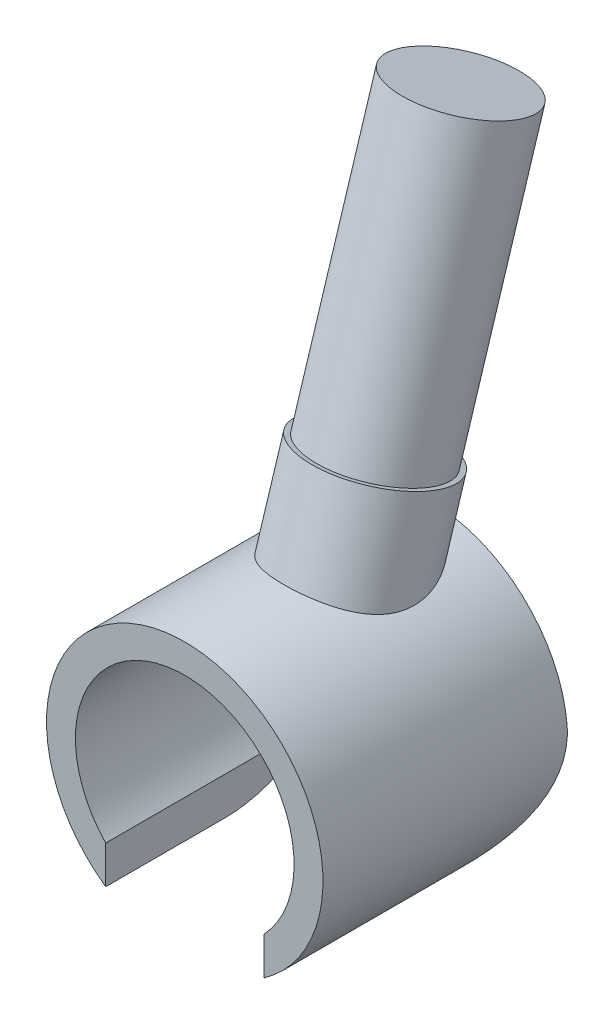
ISO-10303-21;
HEADER;
FILE_DESCRIPTION(('STEP AP214'),'2;1');
FILE_NAME('part.step','',(''),(''),'','','');
FILE_SCHEMA(('AUTOMOTIVE_DESIGN { 1 0 10303 214 1 1 1 1 }'));
ENDSEC;
DATA;
#1=APPLICATION_CONTEXT('core data for automotive mechanical design processes');
#2=APPLICATION_PROTOCOL_DEFINITION('international standard','automotive_design',2000,#1);
#3=PRODUCT_CONTEXT('',#1,'mechanical');
#4=PRODUCT('Part','Part','',(#3));
#5=PRODUCT_RELATED_PRODUCT_CATEGORY('part','',(#4));
#6=PRODUCT_DEFINITION_FORMATION('','',#4);
#7=PRODUCT_DEFINITION_CONTEXT('part definition',#1,'design');
#8=PRODUCT_DEFINITION('design','',#6,#7);
#9=PRODUCT_DEFINITION_SHAPE('','',#8);
#10=(LENGTH_UNIT() NAMED_UNIT(*) SI_UNIT(.MILLI.,.METRE.));
#11=(NAMED_UNIT(*) PLANE_ANGLE_UNIT() SI_UNIT($,.RADIAN.));
#12=(NAMED_UNIT(*) SI_UNIT($,.STERADIAN.) SOLID_ANGLE_UNIT());
#13=UNCERTAINTY_MEASURE_WITH_UNIT(LENGTH_MEASURE(1.E-05),#10,'distance_accuracy_value','');
#14=(GEOMETRIC_REPRESENTATION_CONTEXT(3) GLOBAL_UNCERTAINTY_ASSIGNED_CONTEXT((#13)) GLOBAL_UNIT_ASSIGNED_CONTEXT((#10,
#11,#12)) REPRESENTATION_CONTEXT('',''));
#15=CARTESIAN_POINT('',(0.,0.,0.));
#16=DIRECTION('',(0.,0.,1.));
#17=DIRECTION('',(1.,0.,0.));
#18=AXIS2_PLACEMENT_3D('',#15,#16,#17);
#19=CARTESIAN_POINT('',(1.395,-1.33374472819952,4.32));
#20=DIRECTION('',(1.,0.,0.));
#21=DIRECTION('',(0.,0.,-1.));
#22=AXIS2_PLACEMENT_3D('',#19,#20,#21);
#23=PLANE('',#22);
#24=DIRECTION('',(0.,0.,-1.));
#25=VECTOR('',#24,1.);
#26=CARTESIAN_POINT('',(1.395,-1.33374472819952,4.32));
#27=LINE('',#26,#25);
#28=CARTESIAN_POINT('',(1.395,-1.33374472819952,4.32));
#29=VERTEX_POINT('',#28);
#30=CARTESIAN_POINT('',(1.395,-1.33374472819952,0.632500153890069));
#31=VERTEX_POINT('',#30);
#32=EDGE_CURVE('E128',#29,#31,#27,.T.);
#33=ORIENTED_EDGE('',*,*,#32,.T.);
#34=CARTESIAN_POINT('',(1.395,0.218107145724328,2.22));
#35=DIRECTION('',(1.,0.,0.));
#36=DIRECTION('',(0.,0.,-1.));
#37=AXIS2_PLACEMENT_3D('',#34,#35,#36);
#38=CIRCLE('',#37,2.22);
#39=CARTESIAN_POINT('',(1.395,-2.00189285427567,2.22));
#40=VERTEX_POINT('',#39);
#41=EDGE_CURVE('E111',#31,#40,#38,.F.);
#42=ORIENTED_EDGE('',*,*,#41,.T.);
#43=DIRECTION('',(0.,0.,-1.));
#44=VECTOR('',#43,1.);
#45=CARTESIAN_POINT('',(1.395,-2.00189285427567,4.32));
#46=LINE('',#45,#44);
#47=CARTESIAN_POINT('',(1.395,-2.00189285427567,4.32));
#48=VERTEX_POINT('',#47);
#49=EDGE_CURVE('E124',#48,#40,#46,.T.);
#50=ORIENTED_EDGE('',*,*,#49,.F.);
#51=DIRECTION('',(0.,-1.,0.));
#52=VECTOR('',#51,1.);
#53=CARTESIAN_POINT('',(1.395,-1.33374472819952,4.32));
#54=LINE('',#53,#52);
#55=EDGE_CURVE('E177',#29,#48,#54,.T.);
#56=ORIENTED_EDGE('',*,*,#55,.F.);
#57=EDGE_LOOP('',(#33,#42,#50,#56));
#58=FACE_BOUND('',#57,.T.);
#59=ADVANCED_FACE('F49',(#58),#23,.F.);
#60=CARTESIAN_POINT('',(-1.395,-1.33374472819952,4.32));
#61=DIRECTION('',(-1.,0.,0.));
#62=DIRECTION('',(0.,0.,1.));
#63=AXIS2_PLACEMENT_3D('',#60,#61,#62);
#64=PLANE('',#63);
#65=DIRECTION('',(0.,0.,-1.));
#66=VECTOR('',#65,1.);
#67=CARTESIAN_POINT('',(-1.395,-2.00189285427567,4.32));
#68=LINE('',#67,#66);
#69=CARTESIAN_POINT('',(-1.395,-2.00189285427567,4.32));
#70=VERTEX_POINT('',#69);
#71=CARTESIAN_POINT('',(-1.395,-2.00189285427567,2.22));
#72=VERTEX_POINT('',#71);
#73=EDGE_CURVE('E107',#70,#72,#68,.T.);
#74=ORIENTED_EDGE('',*,*,#73,.T.);
#75=CARTESIAN_POINT('',(-1.395,0.218107145724328,2.22));
#76=DIRECTION('',(-1.,0.,0.));
#77=DIRECTION('',(0.,0.,1.));
#78=AXIS2_PLACEMENT_3D('',#75,#76,#77);
#79=CIRCLE('',#78,2.22);
#80=CARTESIAN_POINT('',(-1.395,-1.33374472819952,0.632500153890069));
#81=VERTEX_POINT('',#80);
#82=EDGE_CURVE('E115',#72,#81,#79,.F.);
#83=ORIENTED_EDGE('',*,*,#82,.T.);
#84=DIRECTION('',(0.,0.,-1.));
#85=VECTOR('',#84,1.);
#86=CARTESIAN_POINT('',(-1.395,-1.33374472819952,4.32));
#87=LINE('',#86,#85);
#88=CARTESIAN_POINT('',(-1.395,-1.33374472819952,4.32));
#89=VERTEX_POINT('',#88);
#90=EDGE_CURVE('E125',#89,#81,#87,.T.);
#91=ORIENTED_EDGE('',*,*,#90,.F.);
#92=DIRECTION('',(0.,1.,0.));
#93=VECTOR('',#92,1.);
#94=CARTESIAN_POINT('',(-1.395,-1.33374472819952,4.32));
#95=LINE('',#94,#93);
#96=EDGE_CURVE('E123',#70,#89,#95,.T.);
#97=ORIENTED_EDGE('',*,*,#96,.F.);
#98=EDGE_LOOP('',(#74,#83,#91,#97));
#99=FACE_BOUND('',#98,.T.);
#100=ADVANCED_FACE('F122',(#99),#64,.F.);
#101=CARTESIAN_POINT('',(0.,0.,4.32));
#102=DIRECTION('',(0.,0.,-1.));
#103=DIRECTION('',(-1.,0.,0.));
#104=AXIS2_PLACEMENT_3D('',#101,#102,#103);
#105=CYLINDRICAL_SURFACE('',#104,2.44);
#106=CARTESIAN_POINT('',(0.,0.,0.));
#107=DIRECTION('',(0.,0.,1.));
#108=DIRECTION('',(1.,0.,0.));
#109=AXIS2_PLACEMENT_3D('',#106,#107,#108);
#110=CIRCLE('',#109,2.44);
#111=CARTESIAN_POINT('',(2.43023234958799,0.218107145724328,0.));
#112=VERTEX_POINT('',#111);
#113=CARTESIAN_POINT('',(-2.43023234958799,0.218107145724328,0.));
#114=VERTEX_POINT('',#113);
#115=EDGE_CURVE('E110',#112,#114,#110,.T.);
#116=ORIENTED_EDGE('',*,*,#115,.T.);
#117=CARTESIAN_POINT('',(-2.43023234958799,0.218107145724328,0.));
#118=CARTESIAN_POINT('',(-2.43474060814688,0.168006973104004,-1.16893598337739E-05));
#119=CARTESIAN_POINT('',(-2.4376758990569,0.117770171176607,0.00169565261850423));
#120=CARTESIAN_POINT('',(-2.44044982061713,0.0174684321543083,0.00851725880222191));
#121=CARTESIAN_POINT('',(-2.44029007287496,-0.0325965811948353,0.0136297375720318));
#122=CARTESIAN_POINT('',(-2.43694014535419,-0.131797724346115,0.027180631125052));
#123=CARTESIAN_POINT('',(-2.4337722090997,-0.180937974329906,0.035594367579917));
#124=CARTESIAN_POINT('',(-2.42457354957555,-0.278274928237632,0.0556345254498708));
#125=CARTESIAN_POINT('',(-2.41854261986041,-0.326471563858177,0.0672611785175166));
#126=CARTESIAN_POINT('',(-2.39642945385073,-0.468959479497071,0.10670607673639));
#127=CARTESIAN_POINT('',(-2.37631639181392,-0.561413034429519,0.13912622722479));
#128=CARTESIAN_POINT('',(-2.3271424912142,-0.739307803663008,0.214719527127823));
#129=CARTESIAN_POINT('',(-2.2980651890097,-0.824735746039993,0.257912433578118));
#130=CARTESIAN_POINT('',(-2.22208906031606,-1.01468152923659,0.369464638794151));
#131=CARTESIAN_POINT('',(-2.1724829619143,-1.11601335843517,0.441407949911391));
#132=CARTESIAN_POINT('',(-2.06564631642221,-1.30321386379243,0.598584113314673));
#133=CARTESIAN_POINT('',(-2.00840177927345,-1.3890534700706,0.683841400598815));
#134=CARTESIAN_POINT('',(-1.88990386745119,-1.54652412301911,0.867452167918425));
#135=CARTESIAN_POINT('',(-1.82859610142771,-1.61786458404172,0.966017802672021));
#136=CARTESIAN_POINT('',(-1.70851989675696,-1.74416017460001,1.1746387892619));
#137=CARTESIAN_POINT('',(-1.64975004265832,-1.79912454107026,1.28468761652329));
#138=CARTESIAN_POINT('',(-1.5612664010109,-1.87569756173117,1.47757925985795));
#139=CARTESIAN_POINT('',(-1.52845436939761,-1.90229801224119,1.5570073475143));
#140=CARTESIAN_POINT('',(-1.47144099361139,-1.94673145245156,1.72097440675392));
#141=CARTESIAN_POINT('',(-1.44719584391018,-1.96460922864679,1.80548471344661));
#142=CARTESIAN_POINT('',(-1.41829905016411,-1.98550395450505,1.94540818672755));
#143=CARTESIAN_POINT('',(-1.40969894116898,-1.9915908726845,1.99954579957669));
#144=CARTESIAN_POINT('',(-1.39798705475527,-1.99981224665755,2.10908636759625));
#145=CARTESIAN_POINT('',(-1.39491468901932,-2.0019183252101,2.16449557859323));
#146=CARTESIAN_POINT('',(-1.395,-2.00189285427567,2.22));
#147=B_SPLINE_CURVE_WITH_KNOTS('',3,(#117,#118,#119,#120,#121,#122,#123,#124,#125,#126,#127,
#128,#129,#130,#131,#132,#133,#134,#135,#136,#137,#138,#139,#140,#141,#142,#143,#144,#145,#146),
.UNSPECIFIED.,.F.,.F.,(4,2,2,2,2,2,2,2,2,2,2,2,2,2,4),(0.,0.150846331968014,0.301613631984807,
0.451274720267462,0.600946601990361,0.899499998603086,1.19860501553043,1.59786296890622,
1.99786247960152,2.40522396872608,2.8123552487426,3.0815494028285,3.34934644287952,
3.51440445371051,3.68063469994443),.UNSPECIFIED.);
#148=EDGE_CURVE('E65',#114,#72,#147,.T.);
#149=ORIENTED_EDGE('',*,*,#148,.T.);
#150=ORIENTED_EDGE('',*,*,#73,.F.);
#151=CARTESIAN_POINT('',(0.,0.,4.32));
#152=DIRECTION('',(0.,0.,1.));
#153=DIRECTION('',(1.,0.,0.));
#154=AXIS2_PLACEMENT_3D('',#151,#152,#153);
#155=CIRCLE('',#154,2.44);
#156=EDGE_CURVE('E221',#48,#70,#155,.T.);
#157=ORIENTED_EDGE('',*,*,#156,.F.);
#158=ORIENTED_EDGE('',*,*,#49,.T.);
#159=CARTESIAN_POINT('',(1.395,-2.00189285427567,2.22));
#160=CARTESIAN_POINT('',(1.39497549417186,-2.00190004682214,2.17903557482983));
#161=CARTESIAN_POINT('',(1.3966286569488,-2.00075856017163,2.13809951432228));
#162=CARTESIAN_POINT('',(1.40307178395955,-1.9962499970007,2.0566756753334));
#163=CARTESIAN_POINT('',(1.40785566693987,-1.99288723506834,2.01618718220667));
#164=CARTESIAN_POINT('',(1.4264029958197,-1.9796983463629,1.89692335415435));
#165=CARTESIAN_POINT('',(1.44437530386783,-1.9667668108115,1.81912641627411));
#166=CARTESIAN_POINT('',(1.49736001707902,-1.92690662521998,1.63769293891108));
#167=CARTESIAN_POINT('',(1.53630355064597,-1.89646085075228,1.53604416243369));
#168=CARTESIAN_POINT('',(1.6228510700733,-1.82296684301684,1.34054904680765));
#169=CARTESIAN_POINT('',(1.67052415633827,-1.77981625547563,1.24677435382125));
#170=CARTESIAN_POINT('',(1.75315039184214,-1.69773154487245,1.0962832244862));
#171=CARTESIAN_POINT('',(1.78725378542758,-1.66191720502314,1.03736038992267));
#172=CARTESIAN_POINT('',(1.85575130772401,-1.58506815034893,0.923196050124291));
#173=CARTESIAN_POINT('',(1.89014553524551,-1.54403158880396,0.867955857754059));
#174=CARTESIAN_POINT('',(1.99203481038013,-1.41334265560728,0.708157008295876));
#175=CARTESIAN_POINT('',(2.05849664197669,-1.31586757883351,0.609073959763263));
#176=CARTESIAN_POINT('',(2.16658026914772,-1.12625881572758,0.450113699351026));
#177=CARTESIAN_POINT('',(2.21034051749566,-1.03842799456176,0.386528311805747));
#178=CARTESIAN_POINT('',(2.2888664736532,-0.85142294309909,0.271538233071784));
#179=CARTESIAN_POINT('',(2.32364287417548,-0.752262402343807,0.220119067649749));
#180=CARTESIAN_POINT('',(2.37640148573411,-0.560852946506085,0.138978516997388));
#181=CARTESIAN_POINT('',(2.3961748234636,-0.470012101160171,0.107107082111706));
#182=CARTESIAN_POINT('',(2.42531006662676,-0.283435705925215,0.055241198727889));
#183=CARTESIAN_POINT('',(2.4346893623598,-0.187708612862025,0.0352269381571692));
#184=CARTESIAN_POINT('',(2.44021747583737,-0.039743307476085,0.014415772204811));
#185=CARTESIAN_POINT('',(2.44051604297717,0.0117535756679152,0.00900756783076575));
#186=CARTESIAN_POINT('',(2.43783986354329,0.11490995245942,0.00179630596058971));
#187=CARTESIAN_POINT('',(2.43486537271731,0.166569433087526,-7.03317871958889E-06));
#188=CARTESIAN_POINT('',(2.43023234958799,0.218107145724328,0.));
#189=B_SPLINE_CURVE_WITH_KNOTS('',3,(#159,#160,#161,#162,#163,#164,#165,#166,#167,#168,#169,
#170,#171,#172,#173,#174,#175,#176,#177,#178,#179,#180,#181,#182,#183,#184,#185,#186,#187,#188),
.UNSPECIFIED.,.F.,.F.,(4,2,2,2,2,2,2,2,2,2,2,2,2,2,4),(0.,0.122794676737796,0.245351536657706,
0.486852474351928,0.824125595645046,1.16419393742833,1.39471038167206,1.62530857052709,
2.08481172056646,2.43436467314526,2.78349964542083,3.07712016359925,3.37024867932407,
3.52538654727439,3.68051229404198),.UNSPECIFIED.);
#190=EDGE_CURVE('E185',#40,#112,#189,.T.);
#191=ORIENTED_EDGE('',*,*,#190,.T.);
#192=EDGE_LOOP('',(#116,#149,#150,#157,#158,#191));
#193=FACE_BOUND('',#192,.T.);
#194=CARTESIAN_POINT('',(0.,2.44,2.57135082263731));
#195=CARTESIAN_POINT('',(0.06530057207931,2.43999803108042,2.5713494499947));
#196=CARTESIAN_POINT('',(0.130622093755175,2.43735576615697,2.56643005484702));
#197=CARTESIAN_POINT('',(0.259401431150824,2.42703336891758,2.54684887442574));
#198=CARTESIAN_POINT('',(0.322858161902783,2.41935036215461,2.53218153039198));
#199=CARTESIAN_POINT('',(0.446043886956785,2.39969411180188,2.49341024802724));
#200=CARTESIAN_POINT('',(0.505776502788804,2.38772511502667,2.46931564860192));
#201=CARTESIAN_POINT('',(0.619983711080263,2.36064975871494,2.41210483150277));
#202=CARTESIAN_POINT('',(0.674457650161402,2.34554301005308,2.37898749472376));
#203=CARTESIAN_POINT('',(0.777290595841827,2.31351563449002,2.3038168942117));
#204=CARTESIAN_POINT('',(0.825571280068302,2.29657598763741,2.26166436453496));
#205=CARTESIAN_POINT('',(0.913871784853914,2.26289084763905,2.16937185045959));
#206=CARTESIAN_POINT('',(0.953893590395186,2.24614530875572,2.11923379048997));
#207=CARTESIAN_POINT('',(1.02352349214199,2.2152695253371,2.01340195585544));
#208=CARTESIAN_POINT('',(1.05337231559192,2.20108322693453,1.95788362056013));
#209=CARTESIAN_POINT('',(1.1031244932909,2.17657842065135,1.84179135030297));
#210=CARTESIAN_POINT('',(1.12303506746608,2.16625710630787,1.78122112287819));
#211=CARTESIAN_POINT('',(1.15153833613523,2.15123256306753,1.66132318782882));
#212=CARTESIAN_POINT('',(1.16081869501244,2.14619007986342,1.60219938983886));
#213=CARTESIAN_POINT('',(1.17068211053481,2.14082566462746,1.48302898222277));
#214=CARTESIAN_POINT('',(1.17126271580205,2.14050506310688,1.42298211726986));
#215=CARTESIAN_POINT('',(1.16423506373046,2.14433449272221,1.30227630320458));
#216=CARTESIAN_POINT('',(1.15645358761399,2.14857909264086,1.24163121362455));
#217=CARTESIAN_POINT('',(1.13319910098491,2.1609325459169,1.12226288078918));
#218=CARTESIAN_POINT('',(1.11772316374878,2.16904286962173,1.06354037788931));
#219=CARTESIAN_POINT('',(1.0767170765982,2.18972342536444,0.939742359286868));
#220=CARTESIAN_POINT('',(1.04997446814819,2.20279960693641,0.875153580819152));
#221=CARTESIAN_POINT('',(0.987764946383581,2.23138781288698,0.750823737928495));
#222=CARTESIAN_POINT('',(0.952285522456568,2.24690331861501,0.691089789930366));
#223=CARTESIAN_POINT('',(0.866969844278439,2.28131417880454,0.56898386944311));
#224=CARTESIAN_POINT('',(0.815769267648238,2.30036411849533,0.507598892094423));
#225=CARTESIAN_POINT('',(0.702746081641514,2.33736282386326,0.395147853191416));
#226=CARTESIAN_POINT('',(0.640942336523951,2.35531346963934,0.344063810313702));
#227=CARTESIAN_POINT('',(0.526915978088909,2.38292498380964,0.268195652438476));
#228=CARTESIAN_POINT('',(0.477123297779669,2.39347936650078,0.240082098125704));
#229=CARTESIAN_POINT('',(0.373291333948903,2.4118504840692,0.191950820236513));
#230=CARTESIAN_POINT('',(0.319256474665445,2.41967002591027,0.171924792563696));
#231=CARTESIAN_POINT('',(0.207765799580773,2.43178827022296,0.141142622825216));
#232=CARTESIAN_POINT('',(0.150288409987917,2.43606156837348,0.130453338496875));
#233=CARTESIAN_POINT('',(0.0341898752733993,2.44045027622977,0.119477004160411));
#234=CARTESIAN_POINT('',(-0.0244307285664939,2.44056760804508,0.119185145404865));
#235=CARTESIAN_POINT('',(-0.1341738753632,2.43685830965271,0.128459814204398));
#236=CARTESIAN_POINT('',(-0.185408298910468,2.43346668739952,0.136938971928881));
#237=CARTESIAN_POINT('',(-0.285698310027524,2.42374018115414,0.161554138273245));
#238=CARTESIAN_POINT('',(-0.334753436338658,2.41740467729643,0.177691759479152));
#239=CARTESIAN_POINT('',(-0.431291719158437,2.40209506527847,0.217401276753675));
#240=CARTESIAN_POINT('',(-0.478663699301288,2.39303811003252,0.241208598837896));
#241=CARTESIAN_POINT('',(-0.569332063833357,2.37310339892995,0.294975614510324));
#242=CARTESIAN_POINT('',(-0.61262686606834,2.36222494074863,0.324937682224812));
#243=CARTESIAN_POINT('',(-0.702251454587684,2.33730215537085,0.395932278013512));
#244=CARTESIAN_POINT('',(-0.74770930045471,2.32304137214549,0.437987021801357));
#245=CARTESIAN_POINT('',(-0.832223906018982,2.2941234583253,0.527999815372727));
#246=CARTESIAN_POINT('',(-0.871274046668777,2.27946593588201,0.575963880974926));
#247=CARTESIAN_POINT('',(-0.950340221066304,2.24780561607845,0.687445513627055));
#248=CARTESIAN_POINT('',(-0.988814902197356,2.230962169129,0.752107459151343));
#249=CARTESIAN_POINT('',(-1.0555381706857,2.20017995575262,0.887171373247642));
#250=CARTESIAN_POINT('',(-1.08378626438139,2.18624132956206,0.957573618716595));
#251=CARTESIAN_POINT('',(-1.12658614300239,2.16446680277572,1.09473340321722));
#252=CARTESIAN_POINT('',(-1.14229924796789,2.15612966927259,1.16104546434163));
#253=CARTESIAN_POINT('',(-1.16382021162268,2.14459271562602,1.29569787891255));
#254=CARTESIAN_POINT('',(-1.16963753590325,2.14138798636622,1.36403623040711));
#255=CARTESIAN_POINT('',(-1.17033167439234,2.14101136213739,1.50136222835111));
#256=CARTESIAN_POINT('',(-1.16512613794288,2.14388487693287,1.57035090151555));
#257=CARTESIAN_POINT('',(-1.14292194545841,2.15580279166821,1.70585775683737));
#258=CARTESIAN_POINT('',(-1.12593000010488,2.16484368011857,1.77237732210699));
#259=CARTESIAN_POINT('',(-1.08319394272923,2.1864992180922,1.89230707226376));
#260=CARTESIAN_POINT('',(-1.05881111491558,2.19852509185328,1.94631608258888));
#261=CARTESIAN_POINT('',(-1.00175894778489,2.22509910319673,2.04907670995926));
#262=CARTESIAN_POINT('',(-0.969088396354224,2.23964760962591,2.0978275564888));
#263=CARTESIAN_POINT('',(-0.896089244840697,2.2698437565163,2.18938589631004));
#264=CARTESIAN_POINT('',(-0.85570913970922,2.28549831575554,2.23214985744467));
#265=CARTESIAN_POINT('',(-0.768456773021096,2.31629319271887,2.31067375646576));
#266=CARTESIAN_POINT('',(-0.721582317750197,2.33143333451789,2.34643131777864));
#267=CARTESIAN_POINT('',(-0.619017251716323,2.36081612525713,2.41265497465667));
#268=CARTESIAN_POINT('',(-0.562941366840128,2.37492460104106,2.44258515612407));
#269=CARTESIAN_POINT('',(-0.446121166554609,2.3996112726627,2.49337295797753));
#270=CARTESIAN_POINT('',(-0.385379026658519,2.41019110149251,2.5142347763927));
#271=CARTESIAN_POINT('',(-0.27071757978636,2.42551296667486,2.54397549132439));
#272=CARTESIAN_POINT('',(-0.217237535005981,2.4309134413503,2.55422728827627));
#273=CARTESIAN_POINT('',(-0.109176511760547,2.43815770929765,2.56791539017786));
#274=CARTESIAN_POINT('',(-0.054595577828097,2.4400016461464,2.57135197025691));
#275=CARTESIAN_POINT('',(0.,2.44,2.57135082263731));
#276=B_SPLINE_CURVE_WITH_KNOTS('',3,(#194,#195,#196,#197,#198,#199,#200,#201,#202,#203,#204,
#205,#206,#207,#208,#209,#210,#211,#212,#213,#214,#215,#216,#217,#218,#219,#220,#221,#222,#223,
#224,#225,#226,#227,#228,#229,#230,#231,#232,#233,#234,#235,#236,#237,#238,#239,#240,#241,#242,
#243,#244,#245,#246,#247,#248,#249,#250,#251,#252,#253,#254,#255,#256,#257,#258,#259,#260,#261,
#262,#263,#264,#265,#266,#267,#268,#269,#270,#271,#272,#273,#274,#275),.UNSPECIFIED.,.T.,.F.,(4,
2,2,2,2,2,2,2,2,2,2,2,2,2,2,2,2,2,2,2,2,2,2,2,2,2,2,2,2,2,2,2,2,2,2,2,2,2,2,2,4),(0.,
0.195703006941414,0.391517709233812,0.587138921091933,0.782784407230017,0.980700949073428,
1.17856986707394,1.37136470527047,1.56401927753215,1.74334639043292,1.92272403238073,
2.10589037075294,2.28912643302301,2.50167913395974,2.71453798617089,2.95985926481141,
3.2047485308609,3.37851962417741,3.55211183668365,3.72693713598632,3.90168157857876,
4.05708853713274,4.21252823310949,4.37328517042449,4.53410423482056,4.72406831648601,
4.91422740896027,5.14459094329916,5.37496559634941,5.5801057591812,5.78504958913706,
5.99152993300067,6.19789281210451,6.37843233112946,6.55899827003932,6.74081562541919,
6.92269454695858,7.11713309383292,7.31148153290816,7.47510873807877,7.63872933750761),.UNSPECIFIED.);
#277=CARTESIAN_POINT('',(0.,2.44,2.57135082263731));
#278=VERTEX_POINT('',#277);
#279=EDGE_CURVE('E134',#278,#278,#276,.T.);
#280=ORIENTED_EDGE('',*,*,#279,.F.);
#281=EDGE_LOOP('',(#280));
#282=FACE_BOUND('',#281,.T.);
#283=ADVANCED_FACE('F103',(#193,#282),#105,.T.);
#284=CARTESIAN_POINT('',(0.,0.,4.32));
#285=DIRECTION('',(0.,0.,-1.));
#286=DIRECTION('',(-1.,0.,0.));
#287=AXIS2_PLACEMENT_3D('',#284,#285,#286);
#288=CYLINDRICAL_SURFACE('',#287,1.93);
#289=ORIENTED_EDGE('',*,*,#90,.T.);
#290=CARTESIAN_POINT('',(-1.395,-1.33374472819952,0.632500153890069));
#291=CARTESIAN_POINT('',(-1.4613650591104,-1.26433642421857,0.564587157345181));
#292=CARTESIAN_POINT('',(-1.52420782443013,-1.18821024003291,0.499154404480811));
#293=CARTESIAN_POINT('',(-1.640340561821,-1.02204651703401,0.375766172623305));
#294=CARTESIAN_POINT('',(-1.69352250187591,-0.931870397557287,0.317897069736298));
#295=CARTESIAN_POINT('',(-1.77666601437336,-0.758659479664662,0.224529929533632));
#296=CARTESIAN_POINT('',(-1.80915593467325,-0.678023834503857,0.186881432235134));
#297=CARTESIAN_POINT('',(-1.86342994800844,-0.510131718898833,0.120925034537264));
#298=CARTESIAN_POINT('',(-1.88528199643524,-0.422921497000987,0.0925582345164513));
#299=CARTESIAN_POINT('',(-1.90875490372367,-0.289105462252127,0.0582336004050142));
#300=CARTESIAN_POINT('',(-1.91501728095762,-0.244296715664213,0.0482015955757541));
#301=CARTESIAN_POINT('',(-1.92439766783169,-0.153814891424226,0.0308925013221703));
#302=CARTESIAN_POINT('',(-1.92751593387305,-0.108141884561813,0.0236151872839506));
#303=CARTESIAN_POINT('',(-1.93049634126748,-0.0157192653420155,0.0118512624809689));
#304=CARTESIAN_POINT('',(-1.93031497838352,0.0310366009128517,0.00740273918684344));
#305=CARTESIAN_POINT('',(-1.92654495623045,0.124627980549224,0.00146965259216349));
#306=CARTESIAN_POINT('',(-1.92295414871276,0.171463525561494,-1.30401454911744E-05));
#307=CARTESIAN_POINT('',(-1.91763637663244,0.218107145724328,0.));
#308=B_SPLINE_CURVE_WITH_KNOTS('',3,(#290,#291,#292,#293,#294,#295,#296,#297,#298,#299,#300,
#301,#302,#303,#304,#305,#306,#307),.UNSPECIFIED.,.F.,.F.,(4,2,2,2,2,2,2,2,4),(0.,
0.353464690607776,0.710666733775624,0.993769033843239,1.27503832028141,1.41390310542213,
1.552756565269,1.693442061618,1.83421626101107),.UNSPECIFIED.);
#309=CARTESIAN_POINT('',(-1.91763637663244,0.218107145724328,0.));
#310=VERTEX_POINT('',#309);
#311=EDGE_CURVE('E112',#81,#310,#308,.T.);
#312=ORIENTED_EDGE('',*,*,#311,.T.);
#313=CARTESIAN_POINT('',(0.,0.,0.));
#314=DIRECTION('',(0.,0.,-1.));
#315=DIRECTION('',(1.,0.,0.));
#316=AXIS2_PLACEMENT_3D('',#313,#314,#315);
#317=CIRCLE('',#316,1.93);
#318=CARTESIAN_POINT('',(1.91763637663244,0.218107145724328,0.));
#319=VERTEX_POINT('',#318);
#320=EDGE_CURVE('E184',#310,#319,#317,.T.);
#321=ORIENTED_EDGE('',*,*,#320,.T.);
#322=CARTESIAN_POINT('',(1.91763637663244,0.218107145724328,0.));
#323=CARTESIAN_POINT('',(1.9226721247151,0.173921329664466,-1.04769769297449E-05));
#324=CARTESIAN_POINT('',(1.92616046455742,0.129562919534623,0.00131890722526243));
#325=CARTESIAN_POINT('',(1.93007409882216,0.04089236162204,0.00664181485806217));
#326=CARTESIAN_POINT('',(1.93050090339903,-0.0034197981875252,0.0106340237426676));
#327=CARTESIAN_POINT('',(1.92834107636795,-0.0911254582141892,0.0212037141522468));
#328=CARTESIAN_POINT('',(1.92579026432846,-0.134523614522696,0.0277498476418316));
#329=CARTESIAN_POINT('',(1.91783974465311,-0.220593766736381,0.0433379096863078));
#330=CARTESIAN_POINT('',(1.91243988541358,-0.26326572387426,0.0523799710424589));
#331=CARTESIAN_POINT('',(1.8921805373519,-0.389613526413221,0.0830506707366588));
#332=CARTESIAN_POINT('',(1.87325516244209,-0.471826598508138,0.108249197349259));
#333=CARTESIAN_POINT('',(1.82590936910417,-0.630798639480565,0.16694905278475));
#334=CARTESIAN_POINT('',(1.79743036630446,-0.707520323030754,0.20050127222276));
#335=CARTESIAN_POINT('',(1.71714167972385,-0.888982483069175,0.291947280226516));
#336=CARTESIAN_POINT('',(1.66067782844072,-0.989693579097232,0.353828389276598));
#337=CARTESIAN_POINT('',(1.5669529542964,-1.12811859799147,0.453843675693397));
#338=CARTESIAN_POINT('',(1.53435151719598,-1.17200588105377,0.488232544456888));
#339=CARTESIAN_POINT('',(1.4665472542806,-1.25579285012763,0.558976640676965));
#340=CARTESIAN_POINT('',(1.43135066747926,-1.29570159006335,0.59532709921544));
#341=CARTESIAN_POINT('',(1.395,-1.33374472819952,0.632500153890069));
#342=B_SPLINE_CURVE_WITH_KNOTS('',3,(#322,#323,#324,#325,#326,#327,#328,#329,#330,#331,#332,
#333,#334,#335,#336,#337,#338,#339,#340,#341),.UNSPECIFIED.,.F.,.F.,(4,2,2,2,2,2,2,2,2,4),(0.,
0.133362580494559,0.266659373096977,0.398369040969633,0.530085718092299,0.792906478518415,
1.05736929023088,1.4476166711137,1.6412301938488,1.83439254166486),.UNSPECIFIED.);
#343=EDGE_CURVE('E73',#319,#31,#342,.T.);
#344=ORIENTED_EDGE('',*,*,#343,.T.);
#345=ORIENTED_EDGE('',*,*,#32,.F.);
#346=CARTESIAN_POINT('',(0.,0.,4.32));
#347=DIRECTION('',(0.,0.,-1.));
#348=DIRECTION('',(1.,0.,0.));
#349=AXIS2_PLACEMENT_3D('',#346,#347,#348);
#350=CIRCLE('',#349,1.93);
#351=EDGE_CURVE('E181',#89,#29,#350,.T.);
#352=ORIENTED_EDGE('',*,*,#351,.F.);
#353=EDGE_LOOP('',(#289,#312,#321,#344,#345,#352));
#354=FACE_BOUND('',#353,.T.);
#355=ADVANCED_FACE('F51',(#354),#288,.F.);
#356=CARTESIAN_POINT('',(0.,0.,4.32));
#357=DIRECTION('',(0.,0.,1.));
#358=DIRECTION('',(1.,0.,0.));
#359=AXIS2_PLACEMENT_3D('',#356,#357,#358);
#360=PLANE('',#359);
#361=ORIENTED_EDGE('',*,*,#351,.T.);
#362=ORIENTED_EDGE('',*,*,#55,.T.);
#363=ORIENTED_EDGE('',*,*,#156,.T.);
#364=ORIENTED_EDGE('',*,*,#96,.T.);
#365=EDGE_LOOP('',(#361,#362,#363,#364));
#366=FACE_BOUND('',#365,.T.);
#367=ADVANCED_FACE('F160',(#366),#360,.T.);
#368=CARTESIAN_POINT('',(0.,0.,0.));
#369=DIRECTION('',(0.,0.,1.));
#370=DIRECTION('',(1.,0.,0.));
#371=AXIS2_PLACEMENT_3D('',#368,#369,#370);
#372=PLANE('',#371);
#373=ORIENTED_EDGE('',*,*,#115,.F.);
#374=DIRECTION('',(1.,0.,0.));
#375=VECTOR('',#374,1.);
#376=CARTESIAN_POINT('',(-2.44,0.218107145724328,0.));
#377=LINE('',#376,#375);
#378=EDGE_CURVE('E12',#112,#319,#377,.F.);
#379=ORIENTED_EDGE('',*,*,#378,.T.);
#380=ORIENTED_EDGE('',*,*,#320,.F.);
#381=EDGE_CURVE('E54',#310,#114,#377,.F.);
#382=ORIENTED_EDGE('',*,*,#381,.T.);
#383=EDGE_LOOP('',(#373,#379,#380,#382));
#384=FACE_BOUND('',#383,.T.);
#385=ADVANCED_FACE('F149',(#384),#372,.F.);
#386=CARTESIAN_POINT('',(0.,-2.45468589434717,2.86956736978179));
#387=DIRECTION('',(0.,0.954812686667351,-0.297208232354144));
#388=DIRECTION('',(0.,0.297208232354144,0.954812686667351));
#389=AXIS2_PLACEMENT_3D('',#386,#387,#388);
#390=CYLINDRICAL_SURFACE('',#389,1.17);
#391=CARTESIAN_POINT('',(0.,3.68000000000279,0.960000000006289));
#392=DIRECTION('',(0.,-0.954812686667351,0.297208232354145));
#393=DIRECTION('',(0.,-0.297208232354145,-0.954812686667351));
#394=AXIS2_PLACEMENT_3D('',#391,#392,#393);
#395=CIRCLE('',#394,1.17);
#396=CARTESIAN_POINT('',(0.,3.33226636814844,-0.157130843394511));
#397=VERTEX_POINT('',#396);
#398=EDGE_CURVE('E217',#397,#397,#395,.T.);
#399=ORIENTED_EDGE('',*,*,#398,.T.);
#400=EDGE_LOOP('',(#399));
#401=FACE_BOUND('',#400,.T.);
#402=ORIENTED_EDGE('',*,*,#279,.T.);
#403=EDGE_LOOP('',(#402));
#404=FACE_BOUND('',#403,.T.);
#405=ADVANCED_FACE('F143',(#401,#404),#390,.T.);
#406=CARTESIAN_POINT('',(0.,3.68000000000279,0.960000000006289));
#407=DIRECTION('',(0.,-0.954812686667351,0.297208232354145));
#408=DIRECTION('',(0.,-0.297208232354145,-0.954812686667351));
#409=AXIS2_PLACEMENT_3D('',#406,#407,#408);
#410=PLANE('',#409);
#411=ORIENTED_EDGE('',*,*,#398,.F.);
#412=EDGE_LOOP('',(#411));
#413=FACE_BOUND('',#412,.T.);
#414=CARTESIAN_POINT('',(0.,3.68000000000279,0.960000000006289));
#415=DIRECTION('',(0.,-0.954812686667351,0.297208232354145));
#416=DIRECTION('',(0.,-0.297208232354145,-0.954812686667351));
#417=AXIS2_PLACEMENT_3D('',#414,#415,#416);
#418=CIRCLE('',#417,1.08);
#419=CARTESIAN_POINT('',(0.,3.35901510906032,-0.0711977015944499));
#420=VERTEX_POINT('',#419);
#421=EDGE_CURVE('E187',#420,#420,#418,.T.);
#422=ORIENTED_EDGE('',*,*,#421,.T.);
#423=EDGE_LOOP('',(#422));
#424=FACE_BOUND('',#423,.T.);
#425=ADVANCED_FACE('F148',(#413,#424),#410,.F.);
#426=CARTESIAN_POINT('',(0.,7.94250847796465,-2.47229528697715));
#427=DIRECTION('',(0.,0.954812686667351,-0.297208232354144));
#428=DIRECTION('',(0.,0.297208232354144,0.954812686667351));
#429=AXIS2_PLACEMENT_3D('',#426,#427,#428);
#430=PLANE('',#429);
#431=CARTESIAN_POINT('',(0.,8.54000000000001,-0.552790968752987));
#432=DIRECTION('',(0.,0.954812686667351,-0.297208232354144));
#433=DIRECTION('',(0.,0.297208232354144,0.954812686667351));
#434=AXIS2_PLACEMENT_3D('',#431,#432,#433);
#435=CIRCLE('',#434,1.08);
#436=CARTESIAN_POINT('',(0.,8.86098489094248,0.478406732847752));
#437=VERTEX_POINT('',#436);
#438=EDGE_CURVE('E214',#437,#437,#435,.T.);
#439=ORIENTED_EDGE('',*,*,#438,.T.);
#440=EDGE_LOOP('',(#439));
#441=FACE_BOUND('',#440,.T.);
#442=ADVANCED_FACE('F152',(#441),#430,.T.);
#443=CARTESIAN_POINT('',(0.,-2.45468589434921,2.86956736977527));
#444=DIRECTION('',(0.,0.954812686667351,-0.297208232354144));
#445=DIRECTION('',(0.,0.297208232354144,0.954812686667351));
#446=AXIS2_PLACEMENT_3D('',#443,#444,#445);
#447=CYLINDRICAL_SURFACE('',#446,1.08);
#448=ORIENTED_EDGE('',*,*,#438,.F.);
#449=EDGE_LOOP('',(#448));
#450=FACE_BOUND('',#449,.T.);
#451=ORIENTED_EDGE('',*,*,#421,.F.);
#452=EDGE_LOOP('',(#451));
#453=FACE_BOUND('',#452,.T.);
#454=ADVANCED_FACE('F155',(#450,#453),#447,.T.);
#455=CARTESIAN_POINT('',(-2.44,0.218107145724328,2.22));
#456=DIRECTION('',(1.,0.,0.));
#457=DIRECTION('',(0.,0.,-1.));
#458=AXIS2_PLACEMENT_3D('',#455,#456,#457);
#459=CYLINDRICAL_SURFACE('',#458,2.22);
#460=ORIENTED_EDGE('',*,*,#381,.F.);
#461=ORIENTED_EDGE('',*,*,#311,.F.);
#462=ORIENTED_EDGE('',*,*,#82,.F.);
#463=ORIENTED_EDGE('',*,*,#148,.F.);
#464=EDGE_LOOP('',(#460,#461,#462,#463));
#465=FACE_BOUND('',#464,.T.);
#466=ADVANCED_FACE('F116',(#465),#459,.T.);
#467=ORIENTED_EDGE('',*,*,#190,.F.);
#468=ORIENTED_EDGE('',*,*,#41,.F.);
#469=ORIENTED_EDGE('',*,*,#343,.F.);
#470=ORIENTED_EDGE('',*,*,#378,.F.);
#471=EDGE_LOOP('',(#467,#468,#469,#470));
#472=FACE_BOUND('',#471,.T.);
#473=ADVANCED_FACE('F199',(#472),#459,.T.);
#474=CLOSED_SHELL('',(#59,#100,#283,#355,#367,#385,#405,#425,#442,#454,#466,#473));
#475=MANIFOLD_SOLID_BREP('B2',#474);
#476=ADVANCED_BREP_SHAPE_REPRESENTATION('',(#18,#475),#14);
#477=SHAPE_DEFINITION_REPRESENTATION(#9,#476);
ENDSEC;
END-ISO-10303-21;
